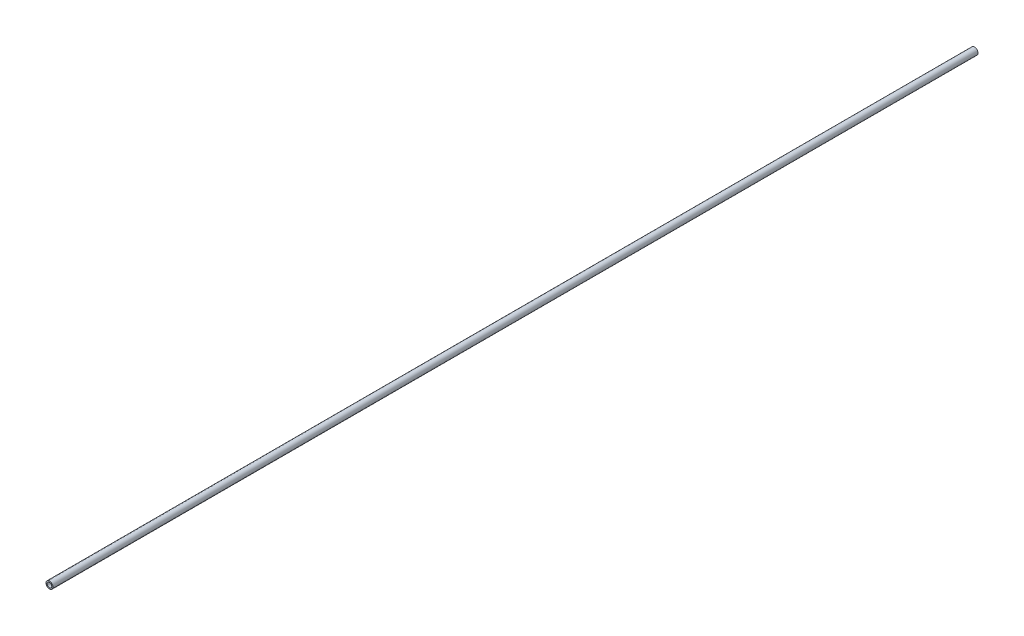
ISO-10303-21;
HEADER;
FILE_DESCRIPTION(('STEP AP214'),'2;1');
FILE_NAME('part.step','',(''),(''),'','','');
FILE_SCHEMA(('AUTOMOTIVE_DESIGN { 1 0 10303 214 1 1 1 1 }'));
ENDSEC;
DATA;
#1=APPLICATION_CONTEXT('core data for automotive mechanical design processes');
#2=APPLICATION_PROTOCOL_DEFINITION('international standard','automotive_design',2000,#1);
#3=PRODUCT_CONTEXT('',#1,'mechanical');
#4=PRODUCT('Part','Part','',(#3));
#5=PRODUCT_RELATED_PRODUCT_CATEGORY('part','',(#4));
#6=PRODUCT_DEFINITION_FORMATION('','',#4);
#7=PRODUCT_DEFINITION_CONTEXT('part definition',#1,'design');
#8=PRODUCT_DEFINITION('design','',#6,#7);
#9=PRODUCT_DEFINITION_SHAPE('','',#8);
#10=(LENGTH_UNIT() NAMED_UNIT(*) SI_UNIT(.MILLI.,.METRE.));
#11=(NAMED_UNIT(*) PLANE_ANGLE_UNIT() SI_UNIT($,.RADIAN.));
#12=(NAMED_UNIT(*) SI_UNIT($,.STERADIAN.) SOLID_ANGLE_UNIT());
#13=UNCERTAINTY_MEASURE_WITH_UNIT(LENGTH_MEASURE(1.E-05),#10,'distance_accuracy_value','');
#14=(GEOMETRIC_REPRESENTATION_CONTEXT(3) GLOBAL_UNCERTAINTY_ASSIGNED_CONTEXT((#13)) GLOBAL_UNIT_ASSIGNED_CONTEXT((#10,
#11,#12)) REPRESENTATION_CONTEXT('',''));
#15=CARTESIAN_POINT('',(0.,0.,0.));
#16=DIRECTION('',(0.,0.,1.));
#17=DIRECTION('',(1.,0.,0.));
#18=AXIS2_PLACEMENT_3D('',#15,#16,#17);
#19=CARTESIAN_POINT('',(0.,0.,800.));
#20=DIRECTION('',(0.,0.,1.));
#21=DIRECTION('',(1.,0.,0.));
#22=AXIS2_PLACEMENT_3D('',#19,#20,#21);
#23=PLANE('',#22);
#24=CARTESIAN_POINT('',(0.,0.,800.));
#25=DIRECTION('',(0.,0.,1.));
#26=DIRECTION('',(1.,0.,0.));
#27=AXIS2_PLACEMENT_3D('',#24,#25,#26);
#28=CIRCLE('',#27,3.);
#29=CARTESIAN_POINT('',(3.,0.,800.));
#30=VERTEX_POINT('',#29);
#31=EDGE_CURVE('E10',#30,#30,#28,.T.);
#32=ORIENTED_EDGE('',*,*,#31,.T.);
#33=EDGE_LOOP('',(#32));
#34=FACE_BOUND('',#33,.T.);
#35=CARTESIAN_POINT('',(0.,0.,800.));
#36=DIRECTION('',(0.,0.,1.));
#37=DIRECTION('',(1.,0.,0.));
#38=AXIS2_PLACEMENT_3D('',#35,#36,#37);
#39=CIRCLE('',#38,2.);
#40=CARTESIAN_POINT('',(2.,0.,800.));
#41=VERTEX_POINT('',#40);
#42=EDGE_CURVE('E50',#41,#41,#39,.T.);
#43=ORIENTED_EDGE('',*,*,#42,.F.);
#44=EDGE_LOOP('',(#43));
#45=FACE_BOUND('',#44,.T.);
#46=ADVANCED_FACE('F39',(#34,#45),#23,.T.);
#47=CARTESIAN_POINT('',(0.,0.,0.));
#48=DIRECTION('',(0.,0.,1.));
#49=DIRECTION('',(1.,0.,0.));
#50=AXIS2_PLACEMENT_3D('',#47,#48,#49);
#51=PLANE('',#50);
#52=CARTESIAN_POINT('',(0.,0.,0.));
#53=DIRECTION('',(0.,0.,1.));
#54=DIRECTION('',(1.,0.,0.));
#55=AXIS2_PLACEMENT_3D('',#52,#53,#54);
#56=CIRCLE('',#55,3.);
#57=CARTESIAN_POINT('',(3.,0.,0.));
#58=VERTEX_POINT('',#57);
#59=EDGE_CURVE('E43',#58,#58,#56,.T.);
#60=ORIENTED_EDGE('',*,*,#59,.F.);
#61=EDGE_LOOP('',(#60));
#62=FACE_BOUND('',#61,.T.);
#63=CARTESIAN_POINT('',(0.,0.,0.));
#64=DIRECTION('',(0.,0.,1.));
#65=DIRECTION('',(1.,0.,0.));
#66=AXIS2_PLACEMENT_3D('',#63,#64,#65);
#67=CIRCLE('',#66,2.);
#68=CARTESIAN_POINT('',(2.,0.,0.));
#69=VERTEX_POINT('',#68);
#70=EDGE_CURVE('E52',#69,#69,#67,.T.);
#71=ORIENTED_EDGE('',*,*,#70,.T.);
#72=EDGE_LOOP('',(#71));
#73=FACE_BOUND('',#72,.T.);
#74=ADVANCED_FACE('F62',(#62,#73),#51,.F.);
#75=CARTESIAN_POINT('',(0.,0.,800.));
#76=DIRECTION('',(0.,0.,-1.));
#77=DIRECTION('',(-1.,0.,0.));
#78=AXIS2_PLACEMENT_3D('',#75,#76,#77);
#79=CYLINDRICAL_SURFACE('',#78,3.);
#80=ORIENTED_EDGE('',*,*,#31,.F.);
#81=EDGE_LOOP('',(#80));
#82=FACE_BOUND('',#81,.T.);
#83=ORIENTED_EDGE('',*,*,#59,.T.);
#84=EDGE_LOOP('',(#83));
#85=FACE_BOUND('',#84,.T.);
#86=ADVANCED_FACE('F41',(#82,#85),#79,.T.);
#87=CARTESIAN_POINT('',(0.,0.,800.));
#88=DIRECTION('',(0.,0.,-1.));
#89=DIRECTION('',(-1.,0.,0.));
#90=AXIS2_PLACEMENT_3D('',#87,#88,#89);
#91=CYLINDRICAL_SURFACE('',#90,2.);
#92=ORIENTED_EDGE('',*,*,#42,.T.);
#93=EDGE_LOOP('',(#92));
#94=FACE_BOUND('',#93,.T.);
#95=ORIENTED_EDGE('',*,*,#70,.F.);
#96=EDGE_LOOP('',(#95));
#97=FACE_BOUND('',#96,.T.);
#98=ADVANCED_FACE('F58',(#94,#97),#91,.F.);
#99=CLOSED_SHELL('',(#46,#74,#86,#98));
#100=MANIFOLD_SOLID_BREP('B2',#99);
#101=ADVANCED_BREP_SHAPE_REPRESENTATION('',(#18,#100),#14);
#102=SHAPE_DEFINITION_REPRESENTATION(#9,#101);
ENDSEC;
END-ISO-10303-21;
